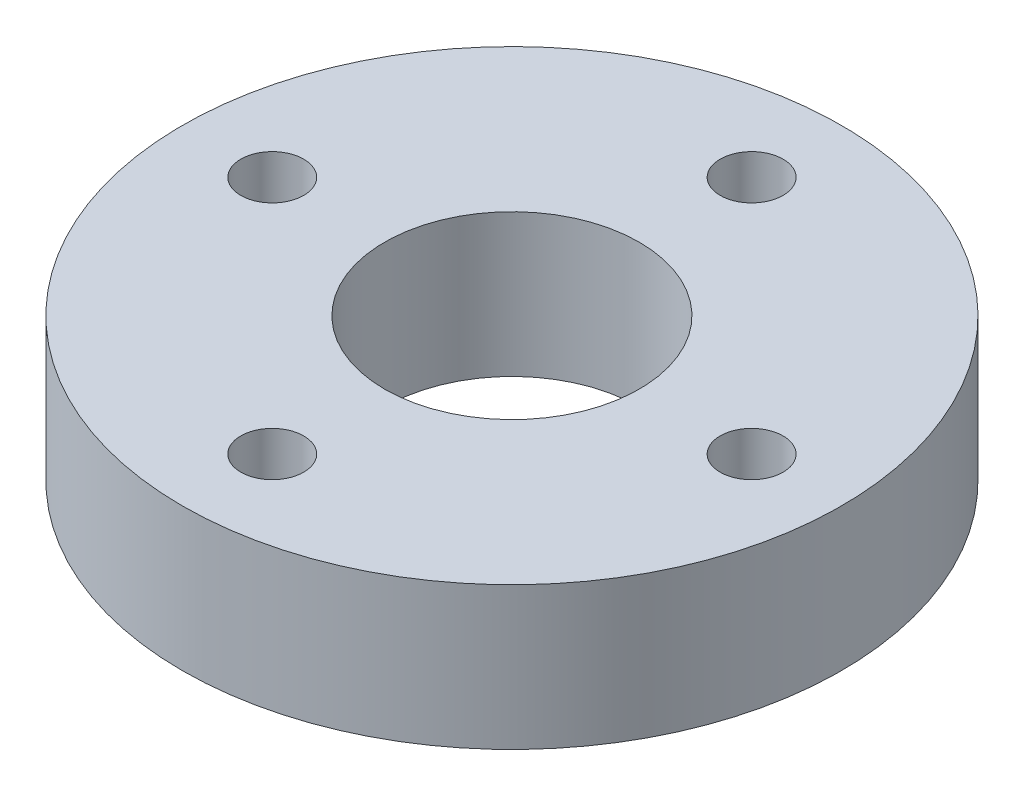
ISO-10303-21;
HEADER;
FILE_DESCRIPTION(('STEP AP214'),'2;1');
FILE_NAME('part.step','',(''),(''),'','','');
FILE_SCHEMA(('AUTOMOTIVE_DESIGN { 1 0 10303 214 1 1 1 1 }'));
ENDSEC;
DATA;
#1=APPLICATION_CONTEXT('core data for automotive mechanical design processes');
#2=APPLICATION_PROTOCOL_DEFINITION('international standard','automotive_design',2000,#1);
#3=PRODUCT_CONTEXT('',#1,'mechanical');
#4=PRODUCT('Part','Part','',(#3));
#5=PRODUCT_RELATED_PRODUCT_CATEGORY('part','',(#4));
#6=PRODUCT_DEFINITION_FORMATION('','',#4);
#7=PRODUCT_DEFINITION_CONTEXT('part definition',#1,'design');
#8=PRODUCT_DEFINITION('design','',#6,#7);
#9=PRODUCT_DEFINITION_SHAPE('','',#8);
#10=(LENGTH_UNIT() NAMED_UNIT(*) SI_UNIT(.MILLI.,.METRE.));
#11=(NAMED_UNIT(*) PLANE_ANGLE_UNIT() SI_UNIT($,.RADIAN.));
#12=(NAMED_UNIT(*) SI_UNIT($,.STERADIAN.) SOLID_ANGLE_UNIT());
#13=UNCERTAINTY_MEASURE_WITH_UNIT(LENGTH_MEASURE(1.E-05),#10,'distance_accuracy_value','');
#14=(GEOMETRIC_REPRESENTATION_CONTEXT(3) GLOBAL_UNCERTAINTY_ASSIGNED_CONTEXT((#13)) GLOBAL_UNIT_ASSIGNED_CONTEXT((#10,
#11,#12)) REPRESENTATION_CONTEXT('',''));
#15=CARTESIAN_POINT('',(0.,0.,0.));
#16=DIRECTION('',(0.,0.,1.));
#17=DIRECTION('',(1.,0.,0.));
#18=AXIS2_PLACEMENT_3D('',#15,#16,#17);
#19=CARTESIAN_POINT('',(0.,4.7625,0.));
#20=DIRECTION('',(0.,-1.,0.));
#21=DIRECTION('',(0.,0.,-1.));
#22=AXIS2_PLACEMENT_3D('',#19,#20,#21);
#23=CYLINDRICAL_SURFACE('',#22,11.);
#24=CARTESIAN_POINT('',(0.,4.7625,0.));
#25=DIRECTION('',(0.,1.,0.));
#26=DIRECTION('',(0.,0.,1.));
#27=AXIS2_PLACEMENT_3D('',#24,#25,#26);
#28=CIRCLE('',#27,11.);
#29=CARTESIAN_POINT('',(0.,4.7625,11.));
#30=VERTEX_POINT('',#29);
#31=EDGE_CURVE('E10',#30,#30,#28,.T.);
#32=ORIENTED_EDGE('',*,*,#31,.F.);
#33=EDGE_LOOP('',(#32));
#34=FACE_BOUND('',#33,.T.);
#35=CARTESIAN_POINT('',(0.,0.,0.));
#36=DIRECTION('',(0.,1.,0.));
#37=DIRECTION('',(0.,0.,1.));
#38=AXIS2_PLACEMENT_3D('',#35,#36,#37);
#39=CIRCLE('',#38,11.);
#40=CARTESIAN_POINT('',(0.,0.,11.));
#41=VERTEX_POINT('',#40);
#42=EDGE_CURVE('E35',#41,#41,#39,.T.);
#43=ORIENTED_EDGE('',*,*,#42,.T.);
#44=EDGE_LOOP('',(#43));
#45=FACE_BOUND('',#44,.T.);
#46=ADVANCED_FACE('F32',(#34,#45),#23,.T.);
#47=CARTESIAN_POINT('',(0.,4.7625,0.));
#48=DIRECTION('',(0.,1.,0.));
#49=DIRECTION('',(0.,0.,1.));
#50=AXIS2_PLACEMENT_3D('',#47,#48,#49);
#51=PLANE('',#50);
#52=CARTESIAN_POINT('',(0.,4.7625,0.));
#53=DIRECTION('',(0.,1.,0.));
#54=DIRECTION('',(0.,0.,1.));
#55=AXIS2_PLACEMENT_3D('',#52,#53,#54);
#56=CIRCLE('',#55,4.25);
#57=CARTESIAN_POINT('',(0.,4.7625,4.25));
#58=VERTEX_POINT('',#57);
#59=EDGE_CURVE('E68',#58,#58,#56,.T.);
#60=ORIENTED_EDGE('',*,*,#59,.F.);
#61=EDGE_LOOP('',(#60));
#62=FACE_BOUND('',#61,.T.);
#63=CARTESIAN_POINT('',(8.,4.7625,0.));
#64=DIRECTION('',(0.,1.,0.));
#65=DIRECTION('',(0.,0.,1.));
#66=AXIS2_PLACEMENT_3D('',#63,#64,#65);
#67=CIRCLE('',#66,1.05);
#68=CARTESIAN_POINT('',(8.,4.7625,1.05));
#69=VERTEX_POINT('',#68);
#70=EDGE_CURVE('E62',#69,#69,#67,.T.);
#71=ORIENTED_EDGE('',*,*,#70,.F.);
#72=EDGE_LOOP('',(#71));
#73=FACE_BOUND('',#72,.T.);
#74=CARTESIAN_POINT('',(0.,4.7625,-8.));
#75=DIRECTION('',(0.,1.,0.));
#76=DIRECTION('',(0.,0.,1.));
#77=AXIS2_PLACEMENT_3D('',#74,#75,#76);
#78=CIRCLE('',#77,1.05);
#79=CARTESIAN_POINT('',(0.,4.7625,-6.95));
#80=VERTEX_POINT('',#79);
#81=EDGE_CURVE('E56',#80,#80,#78,.T.);
#82=ORIENTED_EDGE('',*,*,#81,.F.);
#83=EDGE_LOOP('',(#82));
#84=FACE_BOUND('',#83,.T.);
#85=CARTESIAN_POINT('',(-8.,4.7625,0.));
#86=DIRECTION('',(0.,1.,0.));
#87=DIRECTION('',(0.,0.,1.));
#88=AXIS2_PLACEMENT_3D('',#85,#86,#87);
#89=CIRCLE('',#88,1.05);
#90=CARTESIAN_POINT('',(-8.,4.7625,1.05));
#91=VERTEX_POINT('',#90);
#92=EDGE_CURVE('E50',#91,#91,#89,.T.);
#93=ORIENTED_EDGE('',*,*,#92,.F.);
#94=EDGE_LOOP('',(#93));
#95=FACE_BOUND('',#94,.T.);
#96=CARTESIAN_POINT('',(0.,4.7625,8.));
#97=DIRECTION('',(0.,1.,0.));
#98=DIRECTION('',(0.,0.,1.));
#99=AXIS2_PLACEMENT_3D('',#96,#97,#98);
#100=CIRCLE('',#99,1.05);
#101=CARTESIAN_POINT('',(0.,4.7625,9.05));
#102=VERTEX_POINT('',#101);
#103=EDGE_CURVE('E44',#102,#102,#100,.T.);
#104=ORIENTED_EDGE('',*,*,#103,.F.);
#105=EDGE_LOOP('',(#104));
#106=FACE_BOUND('',#105,.T.);
#107=ORIENTED_EDGE('',*,*,#31,.T.);
#108=EDGE_LOOP('',(#107));
#109=FACE_BOUND('',#108,.T.);
#110=ADVANCED_FACE('F84',(#62,#73,#84,#95,#106,#109),#51,.T.);
#111=CARTESIAN_POINT('',(0.,0.,0.));
#112=DIRECTION('',(0.,1.,0.));
#113=DIRECTION('',(0.,0.,1.));
#114=AXIS2_PLACEMENT_3D('',#111,#112,#113);
#115=PLANE('',#114);
#116=CARTESIAN_POINT('',(0.,0.,0.));
#117=DIRECTION('',(0.,1.,0.));
#118=DIRECTION('',(0.,0.,1.));
#119=AXIS2_PLACEMENT_3D('',#116,#117,#118);
#120=CIRCLE('',#119,4.25);
#121=CARTESIAN_POINT('',(0.,0.,4.25));
#122=VERTEX_POINT('',#121);
#123=EDGE_CURVE('E65',#122,#122,#120,.T.);
#124=ORIENTED_EDGE('',*,*,#123,.T.);
#125=EDGE_LOOP('',(#124));
#126=FACE_BOUND('',#125,.T.);
#127=CARTESIAN_POINT('',(8.,0.,0.));
#128=DIRECTION('',(0.,1.,0.));
#129=DIRECTION('',(0.,0.,1.));
#130=AXIS2_PLACEMENT_3D('',#127,#128,#129);
#131=CIRCLE('',#130,1.05);
#132=CARTESIAN_POINT('',(8.,0.,1.05));
#133=VERTEX_POINT('',#132);
#134=EDGE_CURVE('E59',#133,#133,#131,.T.);
#135=ORIENTED_EDGE('',*,*,#134,.T.);
#136=EDGE_LOOP('',(#135));
#137=FACE_BOUND('',#136,.T.);
#138=CARTESIAN_POINT('',(0.,0.,-8.));
#139=DIRECTION('',(0.,1.,0.));
#140=DIRECTION('',(0.,0.,1.));
#141=AXIS2_PLACEMENT_3D('',#138,#139,#140);
#142=CIRCLE('',#141,1.05);
#143=CARTESIAN_POINT('',(0.,0.,-6.95));
#144=VERTEX_POINT('',#143);
#145=EDGE_CURVE('E53',#144,#144,#142,.T.);
#146=ORIENTED_EDGE('',*,*,#145,.T.);
#147=EDGE_LOOP('',(#146));
#148=FACE_BOUND('',#147,.T.);
#149=CARTESIAN_POINT('',(-8.,0.,0.));
#150=DIRECTION('',(0.,1.,0.));
#151=DIRECTION('',(0.,0.,1.));
#152=AXIS2_PLACEMENT_3D('',#149,#150,#151);
#153=CIRCLE('',#152,1.05);
#154=CARTESIAN_POINT('',(-8.,0.,1.05));
#155=VERTEX_POINT('',#154);
#156=EDGE_CURVE('E47',#155,#155,#153,.T.);
#157=ORIENTED_EDGE('',*,*,#156,.T.);
#158=EDGE_LOOP('',(#157));
#159=FACE_BOUND('',#158,.T.);
#160=CARTESIAN_POINT('',(0.,0.,8.));
#161=DIRECTION('',(0.,1.,0.));
#162=DIRECTION('',(0.,0.,1.));
#163=AXIS2_PLACEMENT_3D('',#160,#161,#162);
#164=CIRCLE('',#163,1.05);
#165=CARTESIAN_POINT('',(0.,0.,9.05));
#166=VERTEX_POINT('',#165);
#167=EDGE_CURVE('E42',#166,#166,#164,.T.);
#168=ORIENTED_EDGE('',*,*,#167,.T.);
#169=EDGE_LOOP('',(#168));
#170=FACE_BOUND('',#169,.T.);
#171=ORIENTED_EDGE('',*,*,#42,.F.);
#172=EDGE_LOOP('',(#171));
#173=FACE_BOUND('',#172,.T.);
#174=ADVANCED_FACE('F74',(#126,#137,#148,#159,#170,#173),#115,.F.);
#175=CARTESIAN_POINT('',(0.,0.,8.));
#176=DIRECTION('',(0.,1.,0.));
#177=DIRECTION('',(0.,0.,1.));
#178=AXIS2_PLACEMENT_3D('',#175,#176,#177);
#179=CYLINDRICAL_SURFACE('',#178,1.05);
#180=ORIENTED_EDGE('',*,*,#167,.F.);
#181=EDGE_LOOP('',(#180));
#182=FACE_BOUND('',#181,.T.);
#183=ORIENTED_EDGE('',*,*,#103,.T.);
#184=EDGE_LOOP('',(#183));
#185=FACE_BOUND('',#184,.T.);
#186=ADVANCED_FACE('F96',(#182,#185),#179,.F.);
#187=CARTESIAN_POINT('',(-8.,0.,0.));
#188=DIRECTION('',(0.,1.,0.));
#189=DIRECTION('',(0.,0.,1.));
#190=AXIS2_PLACEMENT_3D('',#187,#188,#189);
#191=CYLINDRICAL_SURFACE('',#190,1.05);
#192=ORIENTED_EDGE('',*,*,#156,.F.);
#193=EDGE_LOOP('',(#192));
#194=FACE_BOUND('',#193,.T.);
#195=ORIENTED_EDGE('',*,*,#92,.T.);
#196=EDGE_LOOP('',(#195));
#197=FACE_BOUND('',#196,.T.);
#198=ADVANCED_FACE('F98',(#194,#197),#191,.F.);
#199=CARTESIAN_POINT('',(0.,0.,-8.));
#200=DIRECTION('',(0.,1.,0.));
#201=DIRECTION('',(0.,0.,1.));
#202=AXIS2_PLACEMENT_3D('',#199,#200,#201);
#203=CYLINDRICAL_SURFACE('',#202,1.05);
#204=ORIENTED_EDGE('',*,*,#145,.F.);
#205=EDGE_LOOP('',(#204));
#206=FACE_BOUND('',#205,.T.);
#207=ORIENTED_EDGE('',*,*,#81,.T.);
#208=EDGE_LOOP('',(#207));
#209=FACE_BOUND('',#208,.T.);
#210=ADVANCED_FACE('F105',(#206,#209),#203,.F.);
#211=CARTESIAN_POINT('',(8.,0.,0.));
#212=DIRECTION('',(0.,1.,0.));
#213=DIRECTION('',(0.,0.,1.));
#214=AXIS2_PLACEMENT_3D('',#211,#212,#213);
#215=CYLINDRICAL_SURFACE('',#214,1.05);
#216=ORIENTED_EDGE('',*,*,#134,.F.);
#217=EDGE_LOOP('',(#216));
#218=FACE_BOUND('',#217,.T.);
#219=ORIENTED_EDGE('',*,*,#70,.T.);
#220=EDGE_LOOP('',(#219));
#221=FACE_BOUND('',#220,.T.);
#222=ADVANCED_FACE('F80',(#218,#221),#215,.F.);
#223=CARTESIAN_POINT('',(0.,0.,0.));
#224=DIRECTION('',(0.,1.,0.));
#225=DIRECTION('',(0.,0.,1.));
#226=AXIS2_PLACEMENT_3D('',#223,#224,#225);
#227=CYLINDRICAL_SURFACE('',#226,4.25);
#228=ORIENTED_EDGE('',*,*,#123,.F.);
#229=EDGE_LOOP('',(#228));
#230=FACE_BOUND('',#229,.T.);
#231=ORIENTED_EDGE('',*,*,#59,.T.);
#232=EDGE_LOOP('',(#231));
#233=FACE_BOUND('',#232,.T.);
#234=ADVANCED_FACE('F77',(#230,#233),#227,.F.);
#235=CLOSED_SHELL('',(#46,#110,#174,#186,#198,#210,#222,#234));
#236=MANIFOLD_SOLID_BREP('B2',#235);
#237=ADVANCED_BREP_SHAPE_REPRESENTATION('',(#18,#236),#14);
#238=SHAPE_DEFINITION_REPRESENTATION(#9,#237);
ENDSEC;
END-ISO-10303-21;
